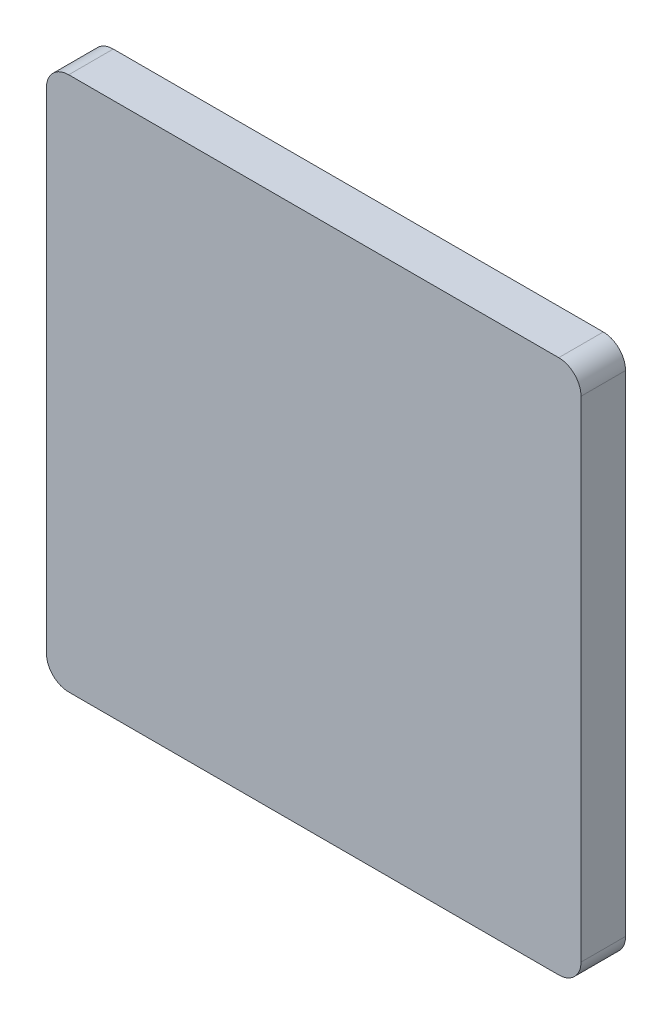
ISO-10303-21;
HEADER;
FILE_DESCRIPTION(('STEP AP214'),'2;1');
FILE_NAME('part.step','',(''),(''),'','','');
FILE_SCHEMA(('AUTOMOTIVE_DESIGN { 1 0 10303 214 1 1 1 1 }'));
ENDSEC;
DATA;
#1=APPLICATION_CONTEXT('core data for automotive mechanical design processes');
#2=APPLICATION_PROTOCOL_DEFINITION('international standard','automotive_design',2000,#1);
#3=PRODUCT_CONTEXT('',#1,'mechanical');
#4=PRODUCT('Part','Part','',(#3));
#5=PRODUCT_RELATED_PRODUCT_CATEGORY('part','',(#4));
#6=PRODUCT_DEFINITION_FORMATION('','',#4);
#7=PRODUCT_DEFINITION_CONTEXT('part definition',#1,'design');
#8=PRODUCT_DEFINITION('design','',#6,#7);
#9=PRODUCT_DEFINITION_SHAPE('','',#8);
#10=(LENGTH_UNIT() NAMED_UNIT(*) SI_UNIT(.MILLI.,.METRE.));
#11=(NAMED_UNIT(*) PLANE_ANGLE_UNIT() SI_UNIT($,.RADIAN.));
#12=(NAMED_UNIT(*) SI_UNIT($,.STERADIAN.) SOLID_ANGLE_UNIT());
#13=UNCERTAINTY_MEASURE_WITH_UNIT(LENGTH_MEASURE(1.E-05),#10,'distance_accuracy_value','');
#14=(GEOMETRIC_REPRESENTATION_CONTEXT(3) GLOBAL_UNCERTAINTY_ASSIGNED_CONTEXT((#13)) GLOBAL_UNIT_ASSIGNED_CONTEXT((#10,
#11,#12)) REPRESENTATION_CONTEXT('',''));
#15=CARTESIAN_POINT('',(0.,0.,0.));
#16=DIRECTION('',(0.,0.,1.));
#17=DIRECTION('',(1.,0.,0.));
#18=AXIS2_PLACEMENT_3D('',#15,#16,#17);
#19=CARTESIAN_POINT('',(38.1,38.1,3.175));
#20=DIRECTION('',(-1.,0.,0.));
#21=DIRECTION('',(0.,0.,1.));
#22=AXIS2_PLACEMENT_3D('',#19,#20,#21);
#23=PLANE('',#22);
#24=DIRECTION('',(0.,1.,0.));
#25=VECTOR('',#24,1.);
#26=CARTESIAN_POINT('',(38.1,38.1,3.175));
#27=LINE('',#26,#25);
#28=CARTESIAN_POINT('',(38.1,-34.925,3.175));
#29=VERTEX_POINT('',#28);
#30=CARTESIAN_POINT('',(38.1,34.925,3.175));
#31=VERTEX_POINT('',#30);
#32=EDGE_CURVE('E127',#29,#31,#27,.T.);
#33=ORIENTED_EDGE('',*,*,#32,.F.);
#34=DIRECTION('',(0.,0.,-1.));
#35=VECTOR('',#34,1.);
#36=CARTESIAN_POINT('',(38.1,-34.925,3.175));
#37=LINE('',#36,#35);
#38=CARTESIAN_POINT('',(38.1,-34.925,-3.175));
#39=VERTEX_POINT('',#38);
#40=EDGE_CURVE('E11',#29,#39,#37,.T.);
#41=ORIENTED_EDGE('',*,*,#40,.T.);
#42=DIRECTION('',(0.,1.,0.));
#43=VECTOR('',#42,1.);
#44=CARTESIAN_POINT('',(38.1,38.1,-3.175));
#45=LINE('',#44,#43);
#46=CARTESIAN_POINT('',(38.1,34.925,-3.175));
#47=VERTEX_POINT('',#46);
#48=EDGE_CURVE('E129',#39,#47,#45,.T.);
#49=ORIENTED_EDGE('',*,*,#48,.T.);
#50=DIRECTION('',(0.,0.,-1.));
#51=VECTOR('',#50,1.);
#52=CARTESIAN_POINT('',(38.1,34.925,3.175));
#53=LINE('',#52,#51);
#54=EDGE_CURVE('E40',#47,#31,#53,.F.);
#55=ORIENTED_EDGE('',*,*,#54,.T.);
#56=EDGE_LOOP('',(#33,#41,#49,#55));
#57=FACE_BOUND('',#56,.T.);
#58=ADVANCED_FACE('F32',(#57),#23,.F.);
#59=CARTESIAN_POINT('',(-38.1,38.1,3.175));
#60=DIRECTION('',(0.,-1.,0.));
#61=DIRECTION('',(0.,0.,-1.));
#62=AXIS2_PLACEMENT_3D('',#59,#60,#61);
#63=PLANE('',#62);
#64=DIRECTION('',(-1.,0.,0.));
#65=VECTOR('',#64,1.);
#66=CARTESIAN_POINT('',(-38.1,38.1,-3.175));
#67=LINE('',#66,#65);
#68=CARTESIAN_POINT('',(34.925,38.1,-3.175));
#69=VERTEX_POINT('',#68);
#70=CARTESIAN_POINT('',(-34.925,38.1,-3.175));
#71=VERTEX_POINT('',#70);
#72=EDGE_CURVE('E125',#69,#71,#67,.T.);
#73=ORIENTED_EDGE('',*,*,#72,.T.);
#74=DIRECTION('',(0.,0.,-1.));
#75=VECTOR('',#74,1.);
#76=CARTESIAN_POINT('',(-34.925,38.1,3.175));
#77=LINE('',#76,#75);
#78=CARTESIAN_POINT('',(-34.925,38.1,3.175));
#79=VERTEX_POINT('',#78);
#80=EDGE_CURVE('E104',#71,#79,#77,.F.);
#81=ORIENTED_EDGE('',*,*,#80,.T.);
#82=DIRECTION('',(-1.,0.,0.));
#83=VECTOR('',#82,1.);
#84=CARTESIAN_POINT('',(-38.1,38.1,3.175));
#85=LINE('',#84,#83);
#86=CARTESIAN_POINT('',(34.925,38.1,3.175));
#87=VERTEX_POINT('',#86);
#88=EDGE_CURVE('E165',#87,#79,#85,.T.);
#89=ORIENTED_EDGE('',*,*,#88,.F.);
#90=DIRECTION('',(0.,0.,-1.));
#91=VECTOR('',#90,1.);
#92=CARTESIAN_POINT('',(34.925,38.1,3.175));
#93=LINE('',#92,#91);
#94=EDGE_CURVE('E109',#87,#69,#93,.T.);
#95=ORIENTED_EDGE('',*,*,#94,.T.);
#96=EDGE_LOOP('',(#73,#81,#89,#95));
#97=FACE_BOUND('',#96,.T.);
#98=ADVANCED_FACE('F169',(#97),#63,.F.);
#99=CARTESIAN_POINT('',(-38.1,38.1,3.175));
#100=DIRECTION('',(1.,0.,0.));
#101=DIRECTION('',(0.,1.,0.));
#102=AXIS2_PLACEMENT_3D('',#99,#100,#101);
#103=PLANE('',#102);
#104=DIRECTION('',(0.,-1.,0.));
#105=VECTOR('',#104,1.);
#106=CARTESIAN_POINT('',(-38.1,38.1,3.175));
#107=LINE('',#106,#105);
#108=CARTESIAN_POINT('',(-38.1,34.925,3.175));
#109=VERTEX_POINT('',#108);
#110=CARTESIAN_POINT('',(-38.1,-34.925,3.175));
#111=VERTEX_POINT('',#110);
#112=EDGE_CURVE('E118',#109,#111,#107,.T.);
#113=ORIENTED_EDGE('',*,*,#112,.F.);
#114=DIRECTION('',(0.,0.,-1.));
#115=VECTOR('',#114,1.);
#116=CARTESIAN_POINT('',(-38.1,34.925,3.175));
#117=LINE('',#116,#115);
#118=CARTESIAN_POINT('',(-38.1,34.925,-3.175));
#119=VERTEX_POINT('',#118);
#120=EDGE_CURVE('E103',#109,#119,#117,.T.);
#121=ORIENTED_EDGE('',*,*,#120,.T.);
#122=DIRECTION('',(0.,-1.,0.));
#123=VECTOR('',#122,1.);
#124=CARTESIAN_POINT('',(-38.1,38.1,-3.175));
#125=LINE('',#124,#123);
#126=CARTESIAN_POINT('',(-38.1,-34.925,-3.175));
#127=VERTEX_POINT('',#126);
#128=EDGE_CURVE('E116',#119,#127,#125,.T.);
#129=ORIENTED_EDGE('',*,*,#128,.T.);
#130=DIRECTION('',(0.,0.,-1.));
#131=VECTOR('',#130,1.);
#132=CARTESIAN_POINT('',(-38.1,-34.925,3.175));
#133=LINE('',#132,#131);
#134=EDGE_CURVE('E120',#127,#111,#133,.F.);
#135=ORIENTED_EDGE('',*,*,#134,.T.);
#136=EDGE_LOOP('',(#113,#121,#129,#135));
#137=FACE_BOUND('',#136,.T.);
#138=ADVANCED_FACE('F115',(#137),#103,.F.);
#139=CARTESIAN_POINT('',(-38.1,-38.1,3.175));
#140=DIRECTION('',(0.,1.,0.));
#141=DIRECTION('',(0.,0.,1.));
#142=AXIS2_PLACEMENT_3D('',#139,#140,#141);
#143=PLANE('',#142);
#144=DIRECTION('',(1.,0.,0.));
#145=VECTOR('',#144,1.);
#146=CARTESIAN_POINT('',(-38.1,-38.1,3.175));
#147=LINE('',#146,#145);
#148=CARTESIAN_POINT('',(-34.925,-38.1,3.175));
#149=VERTEX_POINT('',#148);
#150=CARTESIAN_POINT('',(34.925,-38.1,3.175));
#151=VERTEX_POINT('',#150);
#152=EDGE_CURVE('E133',#149,#151,#147,.T.);
#153=ORIENTED_EDGE('',*,*,#152,.F.);
#154=DIRECTION('',(0.,0.,-1.));
#155=VECTOR('',#154,1.);
#156=CARTESIAN_POINT('',(-34.925,-38.1,3.175));
#157=LINE('',#156,#155);
#158=CARTESIAN_POINT('',(-34.925,-38.1,-3.175));
#159=VERTEX_POINT('',#158);
#160=EDGE_CURVE('E150',#149,#159,#157,.T.);
#161=ORIENTED_EDGE('',*,*,#160,.T.);
#162=DIRECTION('',(1.,0.,0.));
#163=VECTOR('',#162,1.);
#164=CARTESIAN_POINT('',(-38.1,-38.1,-3.175));
#165=LINE('',#164,#163);
#166=CARTESIAN_POINT('',(34.925,-38.1,-3.175));
#167=VERTEX_POINT('',#166);
#168=EDGE_CURVE('E124',#159,#167,#165,.T.);
#169=ORIENTED_EDGE('',*,*,#168,.T.);
#170=DIRECTION('',(0.,0.,-1.));
#171=VECTOR('',#170,1.);
#172=CARTESIAN_POINT('',(34.925,-38.1,3.175));
#173=LINE('',#172,#171);
#174=EDGE_CURVE('E47',#167,#151,#173,.F.);
#175=ORIENTED_EDGE('',*,*,#174,.T.);
#176=EDGE_LOOP('',(#153,#161,#169,#175));
#177=FACE_BOUND('',#176,.T.);
#178=ADVANCED_FACE('F176',(#177),#143,.F.);
#179=CARTESIAN_POINT('',(0.,0.,3.175));
#180=DIRECTION('',(0.,0.,1.));
#181=DIRECTION('',(1.,0.,0.));
#182=AXIS2_PLACEMENT_3D('',#179,#180,#181);
#183=PLANE('',#182);
#184=ORIENTED_EDGE('',*,*,#88,.T.);
#185=CARTESIAN_POINT('',(-34.925,34.925,3.175));
#186=DIRECTION('',(0.,0.,1.));
#187=DIRECTION('',(1.,0.,0.));
#188=AXIS2_PLACEMENT_3D('',#185,#186,#187);
#189=CIRCLE('',#188,3.175);
#190=EDGE_CURVE('E147',#79,#109,#189,.T.);
#191=ORIENTED_EDGE('',*,*,#190,.T.);
#192=ORIENTED_EDGE('',*,*,#112,.T.);
#193=CARTESIAN_POINT('',(-34.925,-34.925,3.175));
#194=DIRECTION('',(0.,0.,1.));
#195=DIRECTION('',(1.,0.,0.));
#196=AXIS2_PLACEMENT_3D('',#193,#194,#195);
#197=CIRCLE('',#196,3.175);
#198=EDGE_CURVE('E54',#111,#149,#197,.T.);
#199=ORIENTED_EDGE('',*,*,#198,.T.);
#200=ORIENTED_EDGE('',*,*,#152,.T.);
#201=CARTESIAN_POINT('',(34.925,-34.925,3.175));
#202=DIRECTION('',(0.,0.,1.));
#203=DIRECTION('',(1.,0.,0.));
#204=AXIS2_PLACEMENT_3D('',#201,#202,#203);
#205=CIRCLE('',#204,3.175);
#206=EDGE_CURVE('E144',#151,#29,#205,.T.);
#207=ORIENTED_EDGE('',*,*,#206,.T.);
#208=ORIENTED_EDGE('',*,*,#32,.T.);
#209=CARTESIAN_POINT('',(34.925,34.925,3.175));
#210=DIRECTION('',(0.,0.,1.));
#211=DIRECTION('',(1.,0.,0.));
#212=AXIS2_PLACEMENT_3D('',#209,#210,#211);
#213=CIRCLE('',#212,3.175);
#214=EDGE_CURVE('E142',#31,#87,#213,.T.);
#215=ORIENTED_EDGE('',*,*,#214,.T.);
#216=EDGE_LOOP('',(#184,#191,#192,#199,#200,#207,#208,#215));
#217=FACE_BOUND('',#216,.T.);
#218=ADVANCED_FACE('F162',(#217),#183,.T.);
#219=CARTESIAN_POINT('',(0.,0.,-3.175));
#220=DIRECTION('',(0.,0.,1.));
#221=DIRECTION('',(1.,0.,0.));
#222=AXIS2_PLACEMENT_3D('',#219,#220,#221);
#223=PLANE('',#222);
#224=ORIENTED_EDGE('',*,*,#128,.F.);
#225=CARTESIAN_POINT('',(-34.925,34.925,-3.175));
#226=DIRECTION('',(0.,0.,1.));
#227=DIRECTION('',(1.,0.,0.));
#228=AXIS2_PLACEMENT_3D('',#225,#226,#227);
#229=CIRCLE('',#228,3.175);
#230=EDGE_CURVE('E99',#119,#71,#229,.F.);
#231=ORIENTED_EDGE('',*,*,#230,.T.);
#232=ORIENTED_EDGE('',*,*,#72,.F.);
#233=CARTESIAN_POINT('',(34.925,34.925,-3.175));
#234=DIRECTION('',(0.,0.,1.));
#235=DIRECTION('',(1.,0.,0.));
#236=AXIS2_PLACEMENT_3D('',#233,#234,#235);
#237=CIRCLE('',#236,3.175);
#238=EDGE_CURVE('E119',#69,#47,#237,.F.);
#239=ORIENTED_EDGE('',*,*,#238,.T.);
#240=ORIENTED_EDGE('',*,*,#48,.F.);
#241=CARTESIAN_POINT('',(34.925,-34.925,-3.175));
#242=DIRECTION('',(0.,0.,1.));
#243=DIRECTION('',(1.,0.,0.));
#244=AXIS2_PLACEMENT_3D('',#241,#242,#243);
#245=CIRCLE('',#244,3.175);
#246=EDGE_CURVE('E136',#39,#167,#245,.F.);
#247=ORIENTED_EDGE('',*,*,#246,.T.);
#248=ORIENTED_EDGE('',*,*,#168,.F.);
#249=CARTESIAN_POINT('',(-34.925,-34.925,-3.175));
#250=DIRECTION('',(0.,0.,1.));
#251=DIRECTION('',(1.,0.,0.));
#252=AXIS2_PLACEMENT_3D('',#249,#250,#251);
#253=CIRCLE('',#252,3.175);
#254=EDGE_CURVE('E110',#159,#127,#253,.F.);
#255=ORIENTED_EDGE('',*,*,#254,.T.);
#256=EDGE_LOOP('',(#224,#231,#232,#239,#240,#247,#248,#255));
#257=FACE_BOUND('',#256,.T.);
#258=ADVANCED_FACE('F122',(#257),#223,.F.);
#259=CARTESIAN_POINT('',(-34.925,34.925,3.175));
#260=DIRECTION('',(0.,0.,-1.));
#261=DIRECTION('',(-1.,0.,0.));
#262=AXIS2_PLACEMENT_3D('',#259,#260,#261);
#263=CYLINDRICAL_SURFACE('',#262,3.175);
#264=ORIENTED_EDGE('',*,*,#190,.F.);
#265=ORIENTED_EDGE('',*,*,#80,.F.);
#266=ORIENTED_EDGE('',*,*,#230,.F.);
#267=ORIENTED_EDGE('',*,*,#120,.F.);
#268=EDGE_LOOP('',(#264,#265,#266,#267));
#269=FACE_BOUND('',#268,.T.);
#270=ADVANCED_FACE('F102',(#269),#263,.T.);
#271=CARTESIAN_POINT('',(-34.925,-34.925,3.175));
#272=DIRECTION('',(0.,0.,-1.));
#273=DIRECTION('',(-1.,0.,0.));
#274=AXIS2_PLACEMENT_3D('',#271,#272,#273);
#275=CYLINDRICAL_SURFACE('',#274,3.175);
#276=ORIENTED_EDGE('',*,*,#198,.F.);
#277=ORIENTED_EDGE('',*,*,#134,.F.);
#278=ORIENTED_EDGE('',*,*,#254,.F.);
#279=ORIENTED_EDGE('',*,*,#160,.F.);
#280=EDGE_LOOP('',(#276,#277,#278,#279));
#281=FACE_BOUND('',#280,.T.);
#282=ADVANCED_FACE('F175',(#281),#275,.T.);
#283=CARTESIAN_POINT('',(34.925,-34.925,3.175));
#284=DIRECTION('',(0.,0.,-1.));
#285=DIRECTION('',(-1.,0.,0.));
#286=AXIS2_PLACEMENT_3D('',#283,#284,#285);
#287=CYLINDRICAL_SURFACE('',#286,3.175);
#288=ORIENTED_EDGE('',*,*,#206,.F.);
#289=ORIENTED_EDGE('',*,*,#174,.F.);
#290=ORIENTED_EDGE('',*,*,#246,.F.);
#291=ORIENTED_EDGE('',*,*,#40,.F.);
#292=EDGE_LOOP('',(#288,#289,#290,#291));
#293=FACE_BOUND('',#292,.T.);
#294=ADVANCED_FACE('F178',(#293),#287,.T.);
#295=CARTESIAN_POINT('',(34.925,34.925,3.175));
#296=DIRECTION('',(0.,0.,-1.));
#297=DIRECTION('',(-1.,0.,0.));
#298=AXIS2_PLACEMENT_3D('',#295,#296,#297);
#299=CYLINDRICAL_SURFACE('',#298,3.175);
#300=ORIENTED_EDGE('',*,*,#214,.F.);
#301=ORIENTED_EDGE('',*,*,#54,.F.);
#302=ORIENTED_EDGE('',*,*,#238,.F.);
#303=ORIENTED_EDGE('',*,*,#94,.F.);
#304=EDGE_LOOP('',(#300,#301,#302,#303));
#305=FACE_BOUND('',#304,.T.);
#306=ADVANCED_FACE('F34',(#305),#299,.T.);
#307=CLOSED_SHELL('',(#58,#98,#138,#178,#218,#258,#270,#282,#294,#306));
#308=MANIFOLD_SOLID_BREP('B2',#307);
#309=ADVANCED_BREP_SHAPE_REPRESENTATION('',(#18,#308),#14);
#310=SHAPE_DEFINITION_REPRESENTATION(#9,#309);
ENDSEC;
END-ISO-10303-21;
